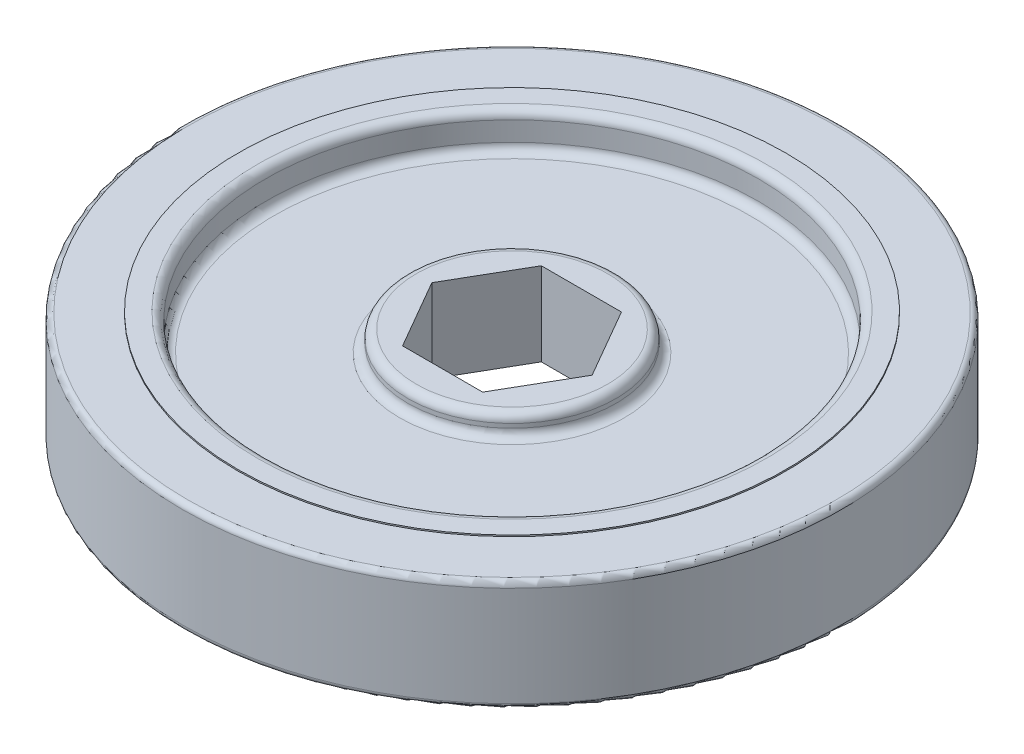
ISO-10303-21;
HEADER;
FILE_DESCRIPTION(('STEP AP214'),'2;1');
FILE_NAME('part.step','',(''),(''),'','','');
FILE_SCHEMA(('AUTOMOTIVE_DESIGN { 1 0 10303 214 1 1 1 1 }'));
ENDSEC;
DATA;
#1=APPLICATION_CONTEXT('core data for automotive mechanical design processes');
#2=APPLICATION_PROTOCOL_DEFINITION('international standard','automotive_design',2000,#1);
#3=PRODUCT_CONTEXT('',#1,'mechanical');
#4=PRODUCT('Part','Part','',(#3));
#5=PRODUCT_RELATED_PRODUCT_CATEGORY('part','',(#4));
#6=PRODUCT_DEFINITION_FORMATION('','',#4);
#7=PRODUCT_DEFINITION_CONTEXT('part definition',#1,'design');
#8=PRODUCT_DEFINITION('design','',#6,#7);
#9=PRODUCT_DEFINITION_SHAPE('','',#8);
#10=(LENGTH_UNIT() NAMED_UNIT(*) SI_UNIT(.MILLI.,.METRE.));
#11=(NAMED_UNIT(*) PLANE_ANGLE_UNIT() SI_UNIT($,.RADIAN.));
#12=(NAMED_UNIT(*) SI_UNIT($,.STERADIAN.) SOLID_ANGLE_UNIT());
#13=UNCERTAINTY_MEASURE_WITH_UNIT(LENGTH_MEASURE(1.E-05),#10,'distance_accuracy_value','');
#14=(GEOMETRIC_REPRESENTATION_CONTEXT(3) GLOBAL_UNCERTAINTY_ASSIGNED_CONTEXT((#13)) GLOBAL_UNIT_ASSIGNED_CONTEXT((#10,
#11,#12)) REPRESENTATION_CONTEXT('',''));
#15=CARTESIAN_POINT('',(0.,0.,0.));
#16=DIRECTION('',(0.,0.,1.));
#17=DIRECTION('',(1.,0.,0.));
#18=AXIS2_PLACEMENT_3D('',#15,#16,#17);
#19=CARTESIAN_POINT('',(0.,5.207,0.));
#20=DIRECTION('',(0.,-1.,0.));
#21=DIRECTION('',(0.,0.,-1.));
#22=AXIS2_PLACEMENT_3D('',#19,#20,#21);
#23=CYLINDRICAL_SURFACE('',#22,22.5425);
#24=CARTESIAN_POINT('',(0.,-2.667,0.));
#25=DIRECTION('',(0.,1.,0.));
#26=DIRECTION('',(0.,0.,1.));
#27=AXIS2_PLACEMENT_3D('',#24,#25,#26);
#28=CIRCLE('',#27,22.5425);
#29=CARTESIAN_POINT('',(0.,-2.667,22.5425));
#30=VERTEX_POINT('',#29);
#31=EDGE_CURVE('E184',#30,#30,#28,.T.);
#32=ORIENTED_EDGE('',*,*,#31,.T.);
#33=EDGE_LOOP('',(#32));
#34=FACE_BOUND('',#33,.T.);
#35=CARTESIAN_POINT('',(0.,-4.445,0.));
#36=DIRECTION('',(0.,1.,0.));
#37=DIRECTION('',(0.,0.,1.));
#38=AXIS2_PLACEMENT_3D('',#35,#36,#37);
#39=CIRCLE('',#38,22.5425);
#40=CARTESIAN_POINT('',(0.,-4.445,22.5425));
#41=VERTEX_POINT('',#40);
#42=EDGE_CURVE('E180',#41,#41,#39,.F.);
#43=ORIENTED_EDGE('',*,*,#42,.T.);
#44=EDGE_LOOP('',(#43));
#45=FACE_BOUND('',#44,.T.);
#46=ADVANCED_FACE('F43',(#34,#45),#23,.F.);
#47=CARTESIAN_POINT('',(0.,5.08,0.));
#48=DIRECTION('',(0.,-1.,0.));
#49=DIRECTION('',(0.,0.,-1.));
#50=AXIS2_PLACEMENT_3D('',#47,#48,#49);
#51=CYLINDRICAL_SURFACE('',#50,30.1625);
#52=CARTESIAN_POINT('',(0.,-4.572,0.));
#53=DIRECTION('',(0.,1.,0.));
#54=DIRECTION('',(0.,0.,1.));
#55=AXIS2_PLACEMENT_3D('',#52,#53,#54);
#56=CIRCLE('',#55,30.1625);
#57=CARTESIAN_POINT('',(0.,-4.572,30.1625));
#58=VERTEX_POINT('',#57);
#59=EDGE_CURVE('E248',#58,#58,#56,.T.);
#60=ORIENTED_EDGE('',*,*,#59,.T.);
#61=EDGE_LOOP('',(#60));
#62=FACE_BOUND('',#61,.T.);
#63=CARTESIAN_POINT('',(0.,4.572,0.));
#64=DIRECTION('',(0.,1.,0.));
#65=DIRECTION('',(0.,0.,1.));
#66=AXIS2_PLACEMENT_3D('',#63,#64,#65);
#67=CIRCLE('',#66,30.1625);
#68=CARTESIAN_POINT('',(0.,4.572,30.1625));
#69=VERTEX_POINT('',#68);
#70=EDGE_CURVE('E244',#69,#69,#67,.F.);
#71=ORIENTED_EDGE('',*,*,#70,.T.);
#72=EDGE_LOOP('',(#71));
#73=FACE_BOUND('',#72,.T.);
#74=ADVANCED_FACE('F264',(#62,#73),#51,.T.);
#75=CARTESIAN_POINT('',(0.,5.08,0.));
#76=DIRECTION('',(0.,1.,0.));
#77=DIRECTION('',(0.,0.,1.));
#78=AXIS2_PLACEMENT_3D('',#75,#76,#77);
#79=PLANE('',#78);
#80=CARTESIAN_POINT('',(0.,5.08,0.));
#81=DIRECTION('',(0.,1.,0.));
#82=DIRECTION('',(0.,0.,1.));
#83=AXIS2_PLACEMENT_3D('',#80,#81,#82);
#84=CIRCLE('',#83,29.6545);
#85=CARTESIAN_POINT('',(0.,5.08,29.6545));
#86=VERTEX_POINT('',#85);
#87=EDGE_CURVE('E11',#86,#86,#84,.T.);
#88=ORIENTED_EDGE('',*,*,#87,.T.);
#89=EDGE_LOOP('',(#88));
#90=FACE_BOUND('',#89,.T.);
#91=CARTESIAN_POINT('',(0.,5.08,0.));
#92=DIRECTION('',(0.,1.,0.));
#93=DIRECTION('',(0.,0.,1.));
#94=AXIS2_PLACEMENT_3D('',#91,#92,#93);
#95=CIRCLE('',#94,25.0825);
#96=CARTESIAN_POINT('',(0.,5.08,25.0825));
#97=VERTEX_POINT('',#96);
#98=EDGE_CURVE('E176',#97,#97,#95,.T.);
#99=ORIENTED_EDGE('',*,*,#98,.F.);
#100=EDGE_LOOP('',(#99));
#101=FACE_BOUND('',#100,.T.);
#102=ADVANCED_FACE('F267',(#90,#101),#79,.T.);
#103=CARTESIAN_POINT('',(0.,-5.08,0.));
#104=DIRECTION('',(0.,1.,0.));
#105=DIRECTION('',(0.,0.,1.));
#106=AXIS2_PLACEMENT_3D('',#103,#104,#105);
#107=PLANE('',#106);
#108=CARTESIAN_POINT('',(0.,-5.08,0.));
#109=DIRECTION('',(0.,1.,0.));
#110=DIRECTION('',(0.,0.,1.));
#111=AXIS2_PLACEMENT_3D('',#108,#109,#110);
#112=CIRCLE('',#111,29.6545);
#113=CARTESIAN_POINT('',(0.,-5.08,29.6545));
#114=VERTEX_POINT('',#113);
#115=EDGE_CURVE('E53',#114,#114,#112,.F.);
#116=ORIENTED_EDGE('',*,*,#115,.T.);
#117=EDGE_LOOP('',(#116));
#118=FACE_BOUND('',#117,.T.);
#119=CARTESIAN_POINT('',(0.,-5.08,0.));
#120=DIRECTION('',(0.,1.,0.));
#121=DIRECTION('',(0.,0.,1.));
#122=AXIS2_PLACEMENT_3D('',#119,#120,#121);
#123=CIRCLE('',#122,25.0825);
#124=CARTESIAN_POINT('',(0.,-5.08,25.0825));
#125=VERTEX_POINT('',#124);
#126=EDGE_CURVE('E169',#125,#125,#123,.F.);
#127=ORIENTED_EDGE('',*,*,#126,.F.);
#128=EDGE_LOOP('',(#127));
#129=FACE_BOUND('',#128,.T.);
#130=ADVANCED_FACE('F255',(#118,#129),#107,.F.);
#131=CARTESIAN_POINT('',(0.,5.207,0.));
#132=DIRECTION('',(0.,-1.,0.));
#133=DIRECTION('',(0.,0.,-1.));
#134=AXIS2_PLACEMENT_3D('',#131,#132,#133);
#135=CYLINDRICAL_SURFACE('',#134,25.0825);
#136=CARTESIAN_POINT('',(0.,-5.207,0.));
#137=DIRECTION('',(0.,1.,0.));
#138=DIRECTION('',(0.,0.,1.));
#139=AXIS2_PLACEMENT_3D('',#136,#137,#138);
#140=CIRCLE('',#139,25.0825);
#141=CARTESIAN_POINT('',(0.,-5.207,25.0825));
#142=VERTEX_POINT('',#141);
#143=EDGE_CURVE('E164',#142,#142,#140,.T.);
#144=ORIENTED_EDGE('',*,*,#143,.T.);
#145=EDGE_LOOP('',(#144));
#146=FACE_BOUND('',#145,.T.);
#147=ORIENTED_EDGE('',*,*,#126,.T.);
#148=EDGE_LOOP('',(#147));
#149=FACE_BOUND('',#148,.T.);
#150=ADVANCED_FACE('F286',(#146,#149),#135,.T.);
#151=CARTESIAN_POINT('',(0.,4.445,0.));
#152=DIRECTION('',(0.,1.,0.));
#153=DIRECTION('',(0.,0.,1.));
#154=AXIS2_PLACEMENT_3D('',#151,#152,#153);
#155=CIRCLE('',#154,22.5425);
#156=CARTESIAN_POINT('',(0.,4.445,22.5425));
#157=VERTEX_POINT('',#156);
#158=EDGE_CURVE('E216',#157,#157,#155,.T.);
#159=ORIENTED_EDGE('',*,*,#158,.T.);
#160=EDGE_LOOP('',(#159));
#161=FACE_BOUND('',#160,.T.);
#162=CARTESIAN_POINT('',(0.,2.667,0.));
#163=DIRECTION('',(0.,1.,0.));
#164=DIRECTION('',(0.,0.,1.));
#165=AXIS2_PLACEMENT_3D('',#162,#163,#164);
#166=CIRCLE('',#165,22.5425);
#167=CARTESIAN_POINT('',(0.,2.667,22.5425));
#168=VERTEX_POINT('',#167);
#169=EDGE_CURVE('E212',#168,#168,#166,.F.);
#170=ORIENTED_EDGE('',*,*,#169,.T.);
#171=EDGE_LOOP('',(#170));
#172=FACE_BOUND('',#171,.T.);
#173=ADVANCED_FACE('F284',(#161,#172),#23,.F.);
#174=ORIENTED_EDGE('',*,*,#98,.T.);
#175=EDGE_LOOP('',(#174));
#176=FACE_BOUND('',#175,.T.);
#177=CARTESIAN_POINT('',(0.,5.207,0.));
#178=DIRECTION('',(0.,1.,0.));
#179=DIRECTION('',(0.,0.,1.));
#180=AXIS2_PLACEMENT_3D('',#177,#178,#179);
#181=CIRCLE('',#180,25.0825);
#182=CARTESIAN_POINT('',(0.,5.207,25.0825));
#183=VERTEX_POINT('',#182);
#184=EDGE_CURVE('E165',#183,#183,#181,.T.);
#185=ORIENTED_EDGE('',*,*,#184,.F.);
#186=EDGE_LOOP('',(#185));
#187=FACE_BOUND('',#186,.T.);
#188=ADVANCED_FACE('F280',(#176,#187),#135,.T.);
#189=CARTESIAN_POINT('',(0.,5.207,0.));
#190=DIRECTION('',(0.,1.,0.));
#191=DIRECTION('',(0.,0.,1.));
#192=AXIS2_PLACEMENT_3D('',#189,#190,#191);
#193=PLANE('',#192);
#194=CARTESIAN_POINT('',(0.,5.207,0.));
#195=DIRECTION('',(0.,1.,0.));
#196=DIRECTION('',(0.,0.,1.));
#197=AXIS2_PLACEMENT_3D('',#194,#195,#196);
#198=CIRCLE('',#197,23.3045);
#199=CARTESIAN_POINT('',(0.,5.207,23.3045));
#200=VERTEX_POINT('',#199);
#201=EDGE_CURVE('E220',#200,#200,#198,.F.);
#202=ORIENTED_EDGE('',*,*,#201,.T.);
#203=EDGE_LOOP('',(#202));
#204=FACE_BOUND('',#203,.T.);
#205=ORIENTED_EDGE('',*,*,#184,.T.);
#206=EDGE_LOOP('',(#205));
#207=FACE_BOUND('',#206,.T.);
#208=ADVANCED_FACE('F283',(#204,#207),#193,.T.);
#209=CARTESIAN_POINT('',(0.,-5.207,0.));
#210=DIRECTION('',(0.,1.,0.));
#211=DIRECTION('',(0.,0.,1.));
#212=AXIS2_PLACEMENT_3D('',#209,#210,#211);
#213=PLANE('',#212);
#214=CARTESIAN_POINT('',(0.,-5.207,0.));
#215=DIRECTION('',(0.,1.,0.));
#216=DIRECTION('',(0.,0.,1.));
#217=AXIS2_PLACEMENT_3D('',#214,#215,#216);
#218=CIRCLE('',#217,23.3045);
#219=CARTESIAN_POINT('',(0.,-5.207,23.3045));
#220=VERTEX_POINT('',#219);
#221=EDGE_CURVE('E208',#220,#220,#218,.T.);
#222=ORIENTED_EDGE('',*,*,#221,.T.);
#223=EDGE_LOOP('',(#222));
#224=FACE_BOUND('',#223,.T.);
#225=ORIENTED_EDGE('',*,*,#143,.F.);
#226=EDGE_LOOP('',(#225));
#227=FACE_BOUND('',#226,.T.);
#228=ADVANCED_FACE('F290',(#224,#227),#213,.F.);
#229=CARTESIAN_POINT('',(0.,1.905,0.));
#230=DIRECTION('',(0.,1.,0.));
#231=DIRECTION('',(0.,0.,1.));
#232=AXIS2_PLACEMENT_3D('',#229,#230,#231);
#233=PLANE('',#232);
#234=CARTESIAN_POINT('',(0.,1.905,0.));
#235=DIRECTION('',(0.,1.,0.));
#236=DIRECTION('',(0.,0.,1.));
#237=AXIS2_PLACEMENT_3D('',#234,#235,#236);
#238=CIRCLE('',#237,21.7805);
#239=CARTESIAN_POINT('',(0.,1.905,21.7805));
#240=VERTEX_POINT('',#239);
#241=EDGE_CURVE('E228',#240,#240,#238,.T.);
#242=ORIENTED_EDGE('',*,*,#241,.T.);
#243=EDGE_LOOP('',(#242));
#244=FACE_BOUND('',#243,.T.);
#245=CARTESIAN_POINT('',(0.,1.905,0.));
#246=DIRECTION('',(0.,1.,0.));
#247=DIRECTION('',(0.,0.,1.));
#248=AXIS2_PLACEMENT_3D('',#245,#246,#247);
#249=CIRCLE('',#248,10.287);
#250=CARTESIAN_POINT('',(0.,1.905,10.287));
#251=VERTEX_POINT('',#250);
#252=EDGE_CURVE('E224',#251,#251,#249,.F.);
#253=ORIENTED_EDGE('',*,*,#252,.T.);
#254=EDGE_LOOP('',(#253));
#255=FACE_BOUND('',#254,.T.);
#256=ADVANCED_FACE('F296',(#244,#255),#233,.T.);
#257=CARTESIAN_POINT('',(0.,-1.905,0.));
#258=DIRECTION('',(0.,1.,0.));
#259=DIRECTION('',(0.,0.,1.));
#260=AXIS2_PLACEMENT_3D('',#257,#258,#259);
#261=PLANE('',#260);
#262=CARTESIAN_POINT('',(0.,-1.905,0.));
#263=DIRECTION('',(0.,1.,0.));
#264=DIRECTION('',(0.,0.,1.));
#265=AXIS2_PLACEMENT_3D('',#262,#263,#264);
#266=CIRCLE('',#265,21.7805);
#267=CARTESIAN_POINT('',(0.,-1.905,21.7805));
#268=VERTEX_POINT('',#267);
#269=EDGE_CURVE('E192',#268,#268,#266,.F.);
#270=ORIENTED_EDGE('',*,*,#269,.T.);
#271=EDGE_LOOP('',(#270));
#272=FACE_BOUND('',#271,.T.);
#273=CARTESIAN_POINT('',(0.,-1.905,0.));
#274=DIRECTION('',(0.,1.,0.));
#275=DIRECTION('',(0.,0.,1.));
#276=AXIS2_PLACEMENT_3D('',#273,#274,#275);
#277=CIRCLE('',#276,10.287);
#278=CARTESIAN_POINT('',(0.,-1.905,10.287));
#279=VERTEX_POINT('',#278);
#280=EDGE_CURVE('E188',#279,#279,#277,.T.);
#281=ORIENTED_EDGE('',*,*,#280,.T.);
#282=EDGE_LOOP('',(#281));
#283=FACE_BOUND('',#282,.T.);
#284=ADVANCED_FACE('F326',(#272,#283),#261,.F.);
#285=CARTESIAN_POINT('',(0.,3.81,0.));
#286=DIRECTION('',(0.,-1.,0.));
#287=DIRECTION('',(0.,0.,-1.));
#288=AXIS2_PLACEMENT_3D('',#285,#286,#287);
#289=CYLINDRICAL_SURFACE('',#288,9.525);
#290=CARTESIAN_POINT('',(0.,-3.048,0.));
#291=DIRECTION('',(0.,1.,0.));
#292=DIRECTION('',(0.,0.,1.));
#293=AXIS2_PLACEMENT_3D('',#290,#291,#292);
#294=CIRCLE('',#293,9.525);
#295=CARTESIAN_POINT('',(0.,-3.048,9.525));
#296=VERTEX_POINT('',#295);
#297=EDGE_CURVE('E200',#296,#296,#294,.T.);
#298=ORIENTED_EDGE('',*,*,#297,.T.);
#299=EDGE_LOOP('',(#298));
#300=FACE_BOUND('',#299,.T.);
#301=CARTESIAN_POINT('',(0.,-2.667,0.));
#302=DIRECTION('',(0.,1.,0.));
#303=DIRECTION('',(0.,0.,1.));
#304=AXIS2_PLACEMENT_3D('',#301,#302,#303);
#305=CIRCLE('',#304,9.525);
#306=CARTESIAN_POINT('',(0.,-2.667,9.525));
#307=VERTEX_POINT('',#306);
#308=EDGE_CURVE('E196',#307,#307,#305,.F.);
#309=ORIENTED_EDGE('',*,*,#308,.T.);
#310=EDGE_LOOP('',(#309));
#311=FACE_BOUND('',#310,.T.);
#312=ADVANCED_FACE('F340',(#300,#311),#289,.T.);
#313=CARTESIAN_POINT('',(5.49926131403119,3.81,-3.175));
#314=DIRECTION('',(-0.866025403784439,0.,0.5));
#315=DIRECTION('',(0.5,0.,0.866025403784439));
#316=AXIS2_PLACEMENT_3D('',#313,#314,#315);
#317=PLANE('',#316);
#318=DIRECTION('',(-0.5,0.,-0.866025403784439));
#319=VECTOR('',#318,1.);
#320=CARTESIAN_POINT('',(5.49926131403119,-3.81,-3.175));
#321=LINE('',#320,#319);
#322=CARTESIAN_POINT('',(7.33234841870825,-3.81,0.));
#323=VERTEX_POINT('',#322);
#324=CARTESIAN_POINT('',(3.66617420935413,-3.81,-6.35));
#325=VERTEX_POINT('',#324);
#326=EDGE_CURVE('E132',#323,#325,#321,.T.);
#327=ORIENTED_EDGE('',*,*,#326,.F.);
#328=DIRECTION('',(0.,-1.,0.));
#329=VECTOR('',#328,1.);
#330=CARTESIAN_POINT('',(7.33234841870825,3.81,0.));
#331=LINE('',#330,#329);
#332=CARTESIAN_POINT('',(7.33234841870825,3.81,0.));
#333=VERTEX_POINT('',#332);
#334=EDGE_CURVE('E90',#333,#323,#331,.T.);
#335=ORIENTED_EDGE('',*,*,#334,.F.);
#336=DIRECTION('',(-0.5,0.,-0.866025403784439));
#337=VECTOR('',#336,1.);
#338=CARTESIAN_POINT('',(5.49926131403119,3.81,-3.175));
#339=LINE('',#338,#337);
#340=CARTESIAN_POINT('',(3.66617420935413,3.81,-6.35));
#341=VERTEX_POINT('',#340);
#342=EDGE_CURVE('E152',#333,#341,#339,.T.);
#343=ORIENTED_EDGE('',*,*,#342,.T.);
#344=DIRECTION('',(0.,-1.,0.));
#345=VECTOR('',#344,1.);
#346=CARTESIAN_POINT('',(3.66617420935413,3.81,-6.35));
#347=LINE('',#346,#345);
#348=EDGE_CURVE('E61',#341,#325,#347,.T.);
#349=ORIENTED_EDGE('',*,*,#348,.T.);
#350=EDGE_LOOP('',(#327,#335,#343,#349));
#351=FACE_BOUND('',#350,.T.);
#352=ADVANCED_FACE('F351',(#351),#317,.T.);
#353=CARTESIAN_POINT('',(5.49926131403119,3.81,3.175));
#354=DIRECTION('',(-0.866025403784438,0.,-0.5));
#355=DIRECTION('',(-0.5,0.,0.866025403784439));
#356=AXIS2_PLACEMENT_3D('',#353,#354,#355);
#357=PLANE('',#356);
#358=DIRECTION('',(0.5,0.,-0.866025403784439));
#359=VECTOR('',#358,1.);
#360=CARTESIAN_POINT('',(5.49926131403119,-3.81,3.175));
#361=LINE('',#360,#359);
#362=CARTESIAN_POINT('',(3.66617420935412,-3.81,6.35));
#363=VERTEX_POINT('',#362);
#364=EDGE_CURVE('E135',#363,#323,#361,.T.);
#365=ORIENTED_EDGE('',*,*,#364,.F.);
#366=DIRECTION('',(0.,-1.,0.));
#367=VECTOR('',#366,1.);
#368=CARTESIAN_POINT('',(3.66617420935412,3.81,6.35));
#369=LINE('',#368,#367);
#370=CARTESIAN_POINT('',(3.66617420935412,3.81,6.35));
#371=VERTEX_POINT('',#370);
#372=EDGE_CURVE('E159',#371,#363,#369,.T.);
#373=ORIENTED_EDGE('',*,*,#372,.F.);
#374=DIRECTION('',(0.5,0.,-0.866025403784439));
#375=VECTOR('',#374,1.);
#376=CARTESIAN_POINT('',(5.49926131403119,3.81,3.175));
#377=LINE('',#376,#375);
#378=EDGE_CURVE('E590',#371,#333,#377,.T.);
#379=ORIENTED_EDGE('',*,*,#378,.T.);
#380=ORIENTED_EDGE('',*,*,#334,.T.);
#381=EDGE_LOOP('',(#365,#373,#379,#380));
#382=FACE_BOUND('',#381,.T.);
#383=ADVANCED_FACE('F357',(#382),#357,.T.);
#384=CARTESIAN_POINT('',(0.,3.81,6.35));
#385=DIRECTION('',(0.,0.,-1.));
#386=DIRECTION('',(-1.,0.,0.));
#387=AXIS2_PLACEMENT_3D('',#384,#385,#386);
#388=PLANE('',#387);
#389=DIRECTION('',(1.,0.,0.));
#390=VECTOR('',#389,1.);
#391=CARTESIAN_POINT('',(0.,-3.81,6.35));
#392=LINE('',#391,#390);
#393=CARTESIAN_POINT('',(-3.66617420935413,-3.81,6.35));
#394=VERTEX_POINT('',#393);
#395=EDGE_CURVE('E139',#394,#363,#392,.T.);
#396=ORIENTED_EDGE('',*,*,#395,.F.);
#397=DIRECTION('',(0.,-1.,0.));
#398=VECTOR('',#397,1.);
#399=CARTESIAN_POINT('',(-3.66617420935413,3.81,6.35));
#400=LINE('',#399,#398);
#401=CARTESIAN_POINT('',(-3.66617420935413,3.81,6.35));
#402=VERTEX_POINT('',#401);
#403=EDGE_CURVE('E111',#402,#394,#400,.T.);
#404=ORIENTED_EDGE('',*,*,#403,.F.);
#405=DIRECTION('',(1.,0.,0.));
#406=VECTOR('',#405,1.);
#407=CARTESIAN_POINT('',(0.,3.81,6.35));
#408=LINE('',#407,#406);
#409=EDGE_CURVE('E121',#402,#371,#408,.T.);
#410=ORIENTED_EDGE('',*,*,#409,.T.);
#411=ORIENTED_EDGE('',*,*,#372,.T.);
#412=EDGE_LOOP('',(#396,#404,#410,#411));
#413=FACE_BOUND('',#412,.T.);
#414=ADVANCED_FACE('F452',(#413),#388,.T.);
#415=CARTESIAN_POINT('',(-5.49926131403119,3.81,3.175));
#416=DIRECTION('',(0.866025403784439,0.,-0.5));
#417=DIRECTION('',(-0.5,0.,-0.866025403784439));
#418=AXIS2_PLACEMENT_3D('',#415,#416,#417);
#419=PLANE('',#418);
#420=DIRECTION('',(0.5,0.,0.866025403784439));
#421=VECTOR('',#420,1.);
#422=CARTESIAN_POINT('',(-5.49926131403119,-3.81,3.175));
#423=LINE('',#422,#421);
#424=CARTESIAN_POINT('',(-7.33234841870825,-3.81,0.));
#425=VERTEX_POINT('',#424);
#426=EDGE_CURVE('E106',#425,#394,#423,.T.);
#427=ORIENTED_EDGE('',*,*,#426,.F.);
#428=DIRECTION('',(0.,-1.,0.));
#429=VECTOR('',#428,1.);
#430=CARTESIAN_POINT('',(-7.33234841870825,3.81,0.));
#431=LINE('',#430,#429);
#432=CARTESIAN_POINT('',(-7.33234841870825,3.81,0.));
#433=VERTEX_POINT('',#432);
#434=EDGE_CURVE('E101',#433,#425,#431,.T.);
#435=ORIENTED_EDGE('',*,*,#434,.F.);
#436=DIRECTION('',(0.5,0.,0.866025403784439));
#437=VECTOR('',#436,1.);
#438=CARTESIAN_POINT('',(-5.49926131403119,3.81,3.175));
#439=LINE('',#438,#437);
#440=EDGE_CURVE('E104',#433,#402,#439,.T.);
#441=ORIENTED_EDGE('',*,*,#440,.T.);
#442=ORIENTED_EDGE('',*,*,#403,.T.);
#443=EDGE_LOOP('',(#427,#435,#441,#442));
#444=FACE_BOUND('',#443,.T.);
#445=ADVANCED_FACE('F103',(#444),#419,.T.);
#446=CARTESIAN_POINT('',(-5.49926131403119,3.81,-3.175));
#447=DIRECTION('',(0.866025403784439,0.,0.5));
#448=DIRECTION('',(0.5,0.,-0.866025403784439));
#449=AXIS2_PLACEMENT_3D('',#446,#447,#448);
#450=PLANE('',#449);
#451=DIRECTION('',(-0.5,0.,0.866025403784439));
#452=VECTOR('',#451,1.);
#453=CARTESIAN_POINT('',(-5.49926131403119,-3.81,-3.175));
#454=LINE('',#453,#452);
#455=CARTESIAN_POINT('',(-3.66617420935413,-3.81,-6.35));
#456=VERTEX_POINT('',#455);
#457=EDGE_CURVE('E145',#456,#425,#454,.T.);
#458=ORIENTED_EDGE('',*,*,#457,.F.);
#459=DIRECTION('',(0.,-1.,0.));
#460=VECTOR('',#459,1.);
#461=CARTESIAN_POINT('',(-3.66617420935413,3.81,-6.35));
#462=LINE('',#461,#460);
#463=CARTESIAN_POINT('',(-3.66617420935413,3.81,-6.35));
#464=VERTEX_POINT('',#463);
#465=EDGE_CURVE('E81',#464,#456,#462,.T.);
#466=ORIENTED_EDGE('',*,*,#465,.F.);
#467=DIRECTION('',(-0.5,0.,0.866025403784439));
#468=VECTOR('',#467,1.);
#469=CARTESIAN_POINT('',(-5.49926131403119,3.81,-3.175));
#470=LINE('',#469,#468);
#471=EDGE_CURVE('E118',#464,#433,#470,.T.);
#472=ORIENTED_EDGE('',*,*,#471,.T.);
#473=ORIENTED_EDGE('',*,*,#434,.T.);
#474=EDGE_LOOP('',(#458,#466,#472,#473));
#475=FACE_BOUND('',#474,.T.);
#476=ADVANCED_FACE('F124',(#475),#450,.T.);
#477=CARTESIAN_POINT('',(0.,3.81,-6.35));
#478=DIRECTION('',(0.,0.,1.));
#479=DIRECTION('',(1.,0.,0.));
#480=AXIS2_PLACEMENT_3D('',#477,#478,#479);
#481=PLANE('',#480);
#482=DIRECTION('',(-1.,0.,0.));
#483=VECTOR('',#482,1.);
#484=CARTESIAN_POINT('',(0.,-3.81,-6.35));
#485=LINE('',#484,#483);
#486=EDGE_CURVE('E148',#325,#456,#485,.T.);
#487=ORIENTED_EDGE('',*,*,#486,.F.);
#488=ORIENTED_EDGE('',*,*,#348,.F.);
#489=DIRECTION('',(-1.,0.,0.));
#490=VECTOR('',#489,1.);
#491=CARTESIAN_POINT('',(0.,3.81,-6.35));
#492=LINE('',#491,#490);
#493=EDGE_CURVE('E126',#341,#464,#492,.T.);
#494=ORIENTED_EDGE('',*,*,#493,.T.);
#495=ORIENTED_EDGE('',*,*,#465,.T.);
#496=EDGE_LOOP('',(#487,#488,#494,#495));
#497=FACE_BOUND('',#496,.T.);
#498=ADVANCED_FACE('F337',(#497),#481,.T.);
#499=CARTESIAN_POINT('',(0.,3.048,0.));
#500=DIRECTION('',(0.,1.,0.));
#501=DIRECTION('',(0.,0.,1.));
#502=AXIS2_PLACEMENT_3D('',#499,#500,#501);
#503=CIRCLE('',#502,9.525);
#504=CARTESIAN_POINT('',(0.,3.048,9.525));
#505=VERTEX_POINT('',#504);
#506=EDGE_CURVE('E240',#505,#505,#503,.F.);
#507=ORIENTED_EDGE('',*,*,#506,.T.);
#508=EDGE_LOOP('',(#507));
#509=FACE_BOUND('',#508,.T.);
#510=CARTESIAN_POINT('',(0.,2.667,0.));
#511=DIRECTION('',(0.,1.,0.));
#512=DIRECTION('',(0.,0.,1.));
#513=AXIS2_PLACEMENT_3D('',#510,#511,#512);
#514=CIRCLE('',#513,9.525);
#515=CARTESIAN_POINT('',(0.,2.667,9.525));
#516=VERTEX_POINT('',#515);
#517=EDGE_CURVE('E236',#516,#516,#514,.T.);
#518=ORIENTED_EDGE('',*,*,#517,.T.);
#519=EDGE_LOOP('',(#518));
#520=FACE_BOUND('',#519,.T.);
#521=ADVANCED_FACE('F335',(#509,#520),#289,.T.);
#522=CARTESIAN_POINT('',(0.,3.81,0.));
#523=DIRECTION('',(0.,1.,0.));
#524=DIRECTION('',(0.,0.,1.));
#525=AXIS2_PLACEMENT_3D('',#522,#523,#524);
#526=PLANE('',#525);
#527=CARTESIAN_POINT('',(0.,3.81,0.));
#528=DIRECTION('',(0.,1.,0.));
#529=DIRECTION('',(0.,0.,1.));
#530=AXIS2_PLACEMENT_3D('',#527,#528,#529);
#531=CIRCLE('',#530,8.763);
#532=CARTESIAN_POINT('',(0.,3.81,8.763));
#533=VERTEX_POINT('',#532);
#534=EDGE_CURVE('E232',#533,#533,#531,.T.);
#535=ORIENTED_EDGE('',*,*,#534,.T.);
#536=EDGE_LOOP('',(#535));
#537=FACE_BOUND('',#536,.T.);
#538=ORIENTED_EDGE('',*,*,#342,.F.);
#539=ORIENTED_EDGE('',*,*,#378,.F.);
#540=ORIENTED_EDGE('',*,*,#409,.F.);
#541=ORIENTED_EDGE('',*,*,#440,.F.);
#542=ORIENTED_EDGE('',*,*,#471,.F.);
#543=ORIENTED_EDGE('',*,*,#493,.F.);
#544=EDGE_LOOP('',(#538,#539,#540,#541,#542,#543));
#545=FACE_BOUND('',#544,.T.);
#546=ADVANCED_FACE('F116',(#537,#545),#526,.T.);
#547=CARTESIAN_POINT('',(0.,-3.81,0.));
#548=DIRECTION('',(0.,1.,0.));
#549=DIRECTION('',(0.,0.,1.));
#550=AXIS2_PLACEMENT_3D('',#547,#548,#549);
#551=PLANE('',#550);
#552=CARTESIAN_POINT('',(0.,-3.81,0.));
#553=DIRECTION('',(0.,1.,0.));
#554=DIRECTION('',(0.,0.,1.));
#555=AXIS2_PLACEMENT_3D('',#552,#553,#554);
#556=CIRCLE('',#555,8.763);
#557=CARTESIAN_POINT('',(0.,-3.81,8.763));
#558=VERTEX_POINT('',#557);
#559=EDGE_CURVE('E204',#558,#558,#556,.F.);
#560=ORIENTED_EDGE('',*,*,#559,.T.);
#561=EDGE_LOOP('',(#560));
#562=FACE_BOUND('',#561,.T.);
#563=ORIENTED_EDGE('',*,*,#326,.T.);
#564=ORIENTED_EDGE('',*,*,#486,.T.);
#565=ORIENTED_EDGE('',*,*,#457,.T.);
#566=ORIENTED_EDGE('',*,*,#426,.T.);
#567=ORIENTED_EDGE('',*,*,#395,.T.);
#568=ORIENTED_EDGE('',*,*,#364,.T.);
#569=EDGE_LOOP('',(#563,#564,#565,#566,#567,#568));
#570=FACE_BOUND('',#569,.T.);
#571=ADVANCED_FACE('F345',(#562,#570),#551,.F.);
#572=CARTESIAN_POINT('',(0.,-2.667,0.));
#573=DIRECTION('',(0.,1.,0.));
#574=DIRECTION('',(0.,0.,1.));
#575=AXIS2_PLACEMENT_3D('',#572,#573,#574);
#576=TOROIDAL_SURFACE('',#575,21.7805,0.762);
#577=ORIENTED_EDGE('',*,*,#269,.F.);
#578=EDGE_LOOP('',(#577));
#579=FACE_BOUND('',#578,.T.);
#580=ORIENTED_EDGE('',*,*,#31,.F.);
#581=EDGE_LOOP('',(#580));
#582=FACE_BOUND('',#581,.T.);
#583=ADVANCED_FACE('F376',(#579,#582),#576,.F.);
#584=CARTESIAN_POINT('',(0.,-3.048,0.));
#585=DIRECTION('',(0.,1.,0.));
#586=DIRECTION('',(0.,0.,1.));
#587=AXIS2_PLACEMENT_3D('',#584,#585,#586);
#588=TOROIDAL_SURFACE('',#587,8.763,0.762);
#589=ORIENTED_EDGE('',*,*,#559,.F.);
#590=EDGE_LOOP('',(#589));
#591=FACE_BOUND('',#590,.T.);
#592=ORIENTED_EDGE('',*,*,#297,.F.);
#593=EDGE_LOOP('',(#592));
#594=FACE_BOUND('',#593,.T.);
#595=ADVANCED_FACE('F367',(#591,#594),#588,.T.);
#596=CARTESIAN_POINT('',(0.,-2.667,0.));
#597=DIRECTION('',(0.,1.,0.));
#598=DIRECTION('',(0.,0.,1.));
#599=AXIS2_PLACEMENT_3D('',#596,#597,#598);
#600=TOROIDAL_SURFACE('',#599,10.287,0.762);
#601=ORIENTED_EDGE('',*,*,#280,.F.);
#602=EDGE_LOOP('',(#601));
#603=FACE_BOUND('',#602,.T.);
#604=ORIENTED_EDGE('',*,*,#308,.F.);
#605=EDGE_LOOP('',(#604));
#606=FACE_BOUND('',#605,.T.);
#607=ADVANCED_FACE('F364',(#603,#606),#600,.F.);
#608=CARTESIAN_POINT('',(0.,-4.445,0.));
#609=DIRECTION('',(0.,1.,0.));
#610=DIRECTION('',(0.,0.,1.));
#611=AXIS2_PLACEMENT_3D('',#608,#609,#610);
#612=TOROIDAL_SURFACE('',#611,23.3045,0.762);
#613=ORIENTED_EDGE('',*,*,#42,.F.);
#614=EDGE_LOOP('',(#613));
#615=FACE_BOUND('',#614,.T.);
#616=ORIENTED_EDGE('',*,*,#221,.F.);
#617=EDGE_LOOP('',(#616));
#618=FACE_BOUND('',#617,.T.);
#619=ADVANCED_FACE('F366',(#615,#618),#612,.T.);
#620=CARTESIAN_POINT('',(0.,4.445,0.));
#621=DIRECTION('',(0.,1.,0.));
#622=DIRECTION('',(0.,0.,1.));
#623=AXIS2_PLACEMENT_3D('',#620,#621,#622);
#624=TOROIDAL_SURFACE('',#623,23.3045,0.762);
#625=ORIENTED_EDGE('',*,*,#201,.F.);
#626=EDGE_LOOP('',(#625));
#627=FACE_BOUND('',#626,.T.);
#628=ORIENTED_EDGE('',*,*,#158,.F.);
#629=EDGE_LOOP('',(#628));
#630=FACE_BOUND('',#629,.T.);
#631=ADVANCED_FACE('F320',(#627,#630),#624,.T.);
#632=CARTESIAN_POINT('',(0.,2.667,0.));
#633=DIRECTION('',(0.,1.,0.));
#634=DIRECTION('',(0.,0.,1.));
#635=AXIS2_PLACEMENT_3D('',#632,#633,#634);
#636=TOROIDAL_SURFACE('',#635,21.7805,0.762);
#637=ORIENTED_EDGE('',*,*,#169,.F.);
#638=EDGE_LOOP('',(#637));
#639=FACE_BOUND('',#638,.T.);
#640=ORIENTED_EDGE('',*,*,#241,.F.);
#641=EDGE_LOOP('',(#640));
#642=FACE_BOUND('',#641,.T.);
#643=ADVANCED_FACE('F316',(#639,#642),#636,.F.);
#644=CARTESIAN_POINT('',(0.,3.048,0.));
#645=DIRECTION('',(0.,1.,0.));
#646=DIRECTION('',(0.,0.,1.));
#647=AXIS2_PLACEMENT_3D('',#644,#645,#646);
#648=TOROIDAL_SURFACE('',#647,8.763,0.762);
#649=ORIENTED_EDGE('',*,*,#506,.F.);
#650=EDGE_LOOP('',(#649));
#651=FACE_BOUND('',#650,.T.);
#652=ORIENTED_EDGE('',*,*,#534,.F.);
#653=EDGE_LOOP('',(#652));
#654=FACE_BOUND('',#653,.T.);
#655=ADVANCED_FACE('F319',(#651,#654),#648,.T.);
#656=CARTESIAN_POINT('',(0.,2.667,0.));
#657=DIRECTION('',(0.,1.,0.));
#658=DIRECTION('',(0.,0.,1.));
#659=AXIS2_PLACEMENT_3D('',#656,#657,#658);
#660=TOROIDAL_SURFACE('',#659,10.287,0.762);
#661=ORIENTED_EDGE('',*,*,#252,.F.);
#662=EDGE_LOOP('',(#661));
#663=FACE_BOUND('',#662,.T.);
#664=ORIENTED_EDGE('',*,*,#517,.F.);
#665=EDGE_LOOP('',(#664));
#666=FACE_BOUND('',#665,.T.);
#667=ADVANCED_FACE('F261',(#663,#666),#660,.F.);
#668=CARTESIAN_POINT('',(0.,-4.572,0.));
#669=DIRECTION('',(0.,1.,0.));
#670=DIRECTION('',(0.,0.,1.));
#671=AXIS2_PLACEMENT_3D('',#668,#669,#670);
#672=TOROIDAL_SURFACE('',#671,29.6545,0.508);
#673=ORIENTED_EDGE('',*,*,#115,.F.);
#674=EDGE_LOOP('',(#673));
#675=FACE_BOUND('',#674,.T.);
#676=ORIENTED_EDGE('',*,*,#59,.F.);
#677=EDGE_LOOP('',(#676));
#678=FACE_BOUND('',#677,.T.);
#679=ADVANCED_FACE('F258',(#675,#678),#672,.T.);
#680=CARTESIAN_POINT('',(0.,4.572,0.));
#681=DIRECTION('',(0.,1.,0.));
#682=DIRECTION('',(0.,0.,1.));
#683=AXIS2_PLACEMENT_3D('',#680,#681,#682);
#684=TOROIDAL_SURFACE('',#683,29.6545,0.508);
#685=ORIENTED_EDGE('',*,*,#70,.F.);
#686=EDGE_LOOP('',(#685));
#687=FACE_BOUND('',#686,.T.);
#688=ORIENTED_EDGE('',*,*,#87,.F.);
#689=EDGE_LOOP('',(#688));
#690=FACE_BOUND('',#689,.T.);
#691=ADVANCED_FACE('F45',(#687,#690),#684,.T.);
#692=CLOSED_SHELL('',(#46,#74,#102,#130,#150,#173,#188,#208,#228,#256,#284,#312,#352,#383,#414,
#445,#476,#498,#521,#546,#571,#583,#595,#607,#619,#631,#643,#655,#667,#679,#691));
#693=MANIFOLD_SOLID_BREP('B2',#692);
#694=ADVANCED_BREP_SHAPE_REPRESENTATION('',(#18,#693),#14);
#695=SHAPE_DEFINITION_REPRESENTATION(#9,#694);
ENDSEC;
END-ISO-10303-21;
